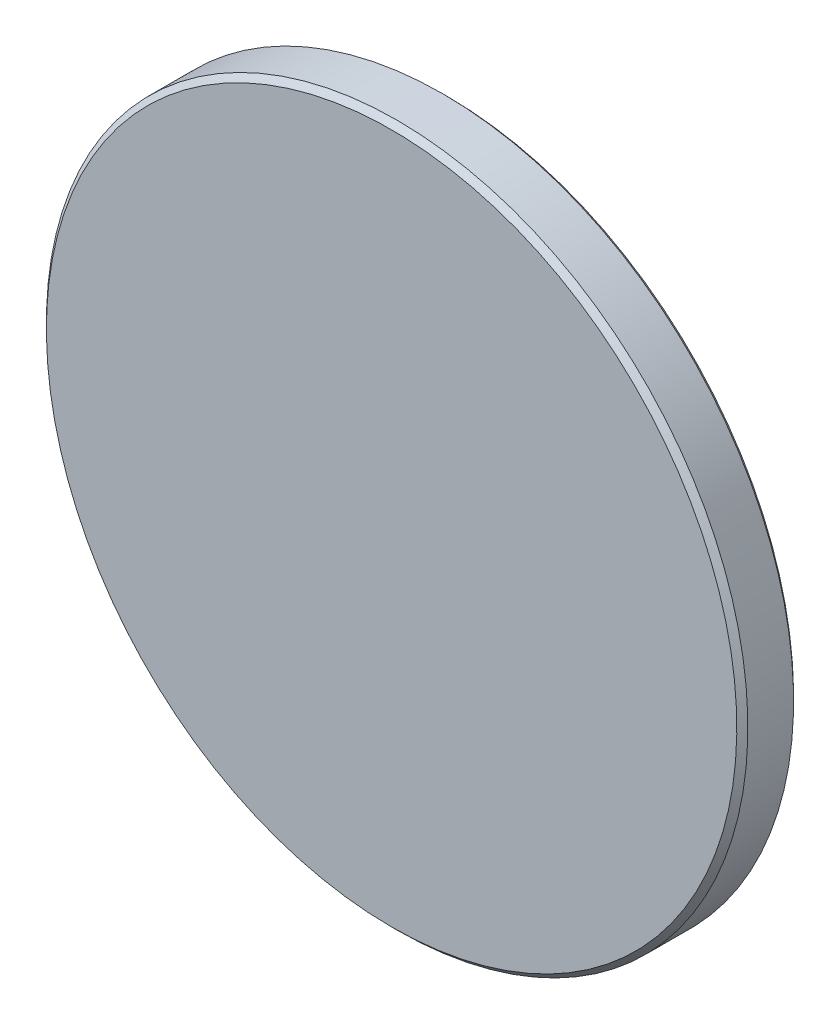
ISO-10303-21;
HEADER;
FILE_DESCRIPTION(('STEP AP214'),'2;1');
FILE_NAME('part.step','',(''),(''),'','','');
FILE_SCHEMA(('AUTOMOTIVE_DESIGN { 1 0 10303 214 1 1 1 1 }'));
ENDSEC;
DATA;
#1=APPLICATION_CONTEXT('core data for automotive mechanical design processes');
#2=APPLICATION_PROTOCOL_DEFINITION('international standard','automotive_design',2000,#1);
#3=PRODUCT_CONTEXT('',#1,'mechanical');
#4=PRODUCT('Part','Part','',(#3));
#5=PRODUCT_RELATED_PRODUCT_CATEGORY('part','',(#4));
#6=PRODUCT_DEFINITION_FORMATION('','',#4);
#7=PRODUCT_DEFINITION_CONTEXT('part definition',#1,'design');
#8=PRODUCT_DEFINITION('design','',#6,#7);
#9=PRODUCT_DEFINITION_SHAPE('','',#8);
#10=(LENGTH_UNIT() NAMED_UNIT(*) SI_UNIT(.MILLI.,.METRE.));
#11=(NAMED_UNIT(*) PLANE_ANGLE_UNIT() SI_UNIT($,.RADIAN.));
#12=(NAMED_UNIT(*) SI_UNIT($,.STERADIAN.) SOLID_ANGLE_UNIT());
#13=UNCERTAINTY_MEASURE_WITH_UNIT(LENGTH_MEASURE(1.E-05),#10,'distance_accuracy_value','');
#14=(GEOMETRIC_REPRESENTATION_CONTEXT(3) GLOBAL_UNCERTAINTY_ASSIGNED_CONTEXT((#13)) GLOBAL_UNIT_ASSIGNED_CONTEXT((#10,
#11,#12)) REPRESENTATION_CONTEXT('',''));
#15=CARTESIAN_POINT('',(0.,0.,0.));
#16=DIRECTION('',(0.,0.,1.));
#17=DIRECTION('',(1.,0.,0.));
#18=AXIS2_PLACEMENT_3D('',#15,#16,#17);
#19=CARTESIAN_POINT('',(0.,-1.28754159713456E-13,700.275));
#20=DIRECTION('',(0.,0.,-1.));
#21=DIRECTION('',(0.,1.,0.));
#22=AXIS2_PLACEMENT_3D('',#19,#20,#21);
#23=SPHERICAL_SURFACE('',#22,701.33);
#24=CARTESIAN_POINT('',(0.,0.,-0.942548983515202));
#25=DIRECTION('',(0.,0.,-1.));
#26=DIRECTION('',(0.,1.,0.));
#27=AXIS2_PLACEMENT_3D('',#24,#25,#26);
#28=CIRCLE('',#27,12.5585786437627);
#29=CARTESIAN_POINT('',(0.,12.5585786437627,-0.9425489835152));
#30=VERTEX_POINT('',#29);
#31=EDGE_CURVE('E28',#30,#30,#28,.T.);
#32=ORIENTED_EDGE('',*,*,#31,.T.);
#33=EDGE_LOOP('',(#32));
#34=FACE_BOUND('',#33,.T.);
#35=ADVANCED_FACE('F13',(#34),#23,.T.);
#36=CARTESIAN_POINT('',(0.,0.,1.055));
#37=DIRECTION('',(0.,0.,1.));
#38=DIRECTION('',(0.,-1.,0.));
#39=AXIS2_PLACEMENT_3D('',#36,#37,#38);
#40=PLANE('',#39);
#41=CARTESIAN_POINT('',(0.,0.,1.055));
#42=DIRECTION('',(0.,0.,1.));
#43=DIRECTION('',(0.,-1.,0.));
#44=AXIS2_PLACEMENT_3D('',#41,#42,#43);
#45=CIRCLE('',#44,12.5);
#46=CARTESIAN_POINT('',(0.,-12.5,1.055));
#47=VERTEX_POINT('',#46);
#48=EDGE_CURVE('E9',#47,#47,#45,.T.);
#49=ORIENTED_EDGE('',*,*,#48,.T.);
#50=EDGE_LOOP('',(#49));
#51=FACE_BOUND('',#50,.T.);
#52=ADVANCED_FACE('F46',(#51),#40,.T.);
#53=CARTESIAN_POINT('',(0.,0.,-1.055));
#54=DIRECTION('',(0.,0.,-1.));
#55=DIRECTION('',(0.,1.,0.));
#56=AXIS2_PLACEMENT_3D('',#53,#54,#55);
#57=CYLINDRICAL_SURFACE('',#56,12.7);
#58=CARTESIAN_POINT('',(0.,0.,0.855000000000002));
#59=DIRECTION('',(0.,0.,1.));
#60=DIRECTION('',(0.,-1.,0.));
#61=AXIS2_PLACEMENT_3D('',#58,#59,#60);
#62=CIRCLE('',#61,12.7);
#63=CARTESIAN_POINT('',(0.,-12.7,0.855000000000001));
#64=VERTEX_POINT('',#63);
#65=EDGE_CURVE('E20',#64,#64,#62,.F.);
#66=ORIENTED_EDGE('',*,*,#65,.T.);
#67=EDGE_LOOP('',(#66));
#68=FACE_BOUND('',#67,.T.);
#69=CARTESIAN_POINT('',(0.,0.,-0.801127627277893));
#70=DIRECTION('',(0.,0.,-1.));
#71=DIRECTION('',(0.,1.,0.));
#72=AXIS2_PLACEMENT_3D('',#69,#70,#71);
#73=CIRCLE('',#72,12.7);
#74=CARTESIAN_POINT('',(0.,12.7,-0.801127627277891));
#75=VERTEX_POINT('',#74);
#76=EDGE_CURVE('E24',#75,#75,#73,.T.);
#77=ORIENTED_EDGE('',*,*,#76,.F.);
#78=EDGE_LOOP('',(#77));
#79=FACE_BOUND('',#78,.T.);
#80=ADVANCED_FACE('F37',(#68,#79),#57,.T.);
#81=CARTESIAN_POINT('',(0.,0.,-0.942548983515202));
#82=DIRECTION('',(0.,0.,1.));
#83=DIRECTION('',(0.,-1.,0.));
#84=AXIS2_PLACEMENT_3D('',#81,#82,#83);
#85=CONICAL_SURFACE('',#84,12.5585786437627,0.78539816339745);
#86=ORIENTED_EDGE('',*,*,#76,.T.);
#87=EDGE_LOOP('',(#86));
#88=FACE_BOUND('',#87,.T.);
#89=ORIENTED_EDGE('',*,*,#31,.F.);
#90=EDGE_LOOP('',(#89));
#91=FACE_BOUND('',#90,.T.);
#92=ADVANCED_FACE('F35',(#88,#91),#85,.T.);
#93=CARTESIAN_POINT('',(0.,0.,0.855000000000002));
#94=DIRECTION('',(0.,0.,-1.));
#95=DIRECTION('',(0.,1.,0.));
#96=AXIS2_PLACEMENT_3D('',#93,#94,#95);
#97=CONICAL_SURFACE('',#96,12.7,0.785398163397453);
#98=ORIENTED_EDGE('',*,*,#48,.F.);
#99=EDGE_LOOP('',(#98));
#100=FACE_BOUND('',#99,.T.);
#101=ORIENTED_EDGE('',*,*,#65,.F.);
#102=EDGE_LOOP('',(#101));
#103=FACE_BOUND('',#102,.T.);
#104=ADVANCED_FACE('F15',(#100,#103),#97,.T.);
#105=CLOSED_SHELL('',(#35,#52,#80,#92,#104));
#106=MANIFOLD_SOLID_BREP('B1',#105);
#107=ADVANCED_BREP_SHAPE_REPRESENTATION('',(#18,#106),#14);
#108=SHAPE_DEFINITION_REPRESENTATION(#9,#107);
ENDSEC;
END-ISO-10303-21;
